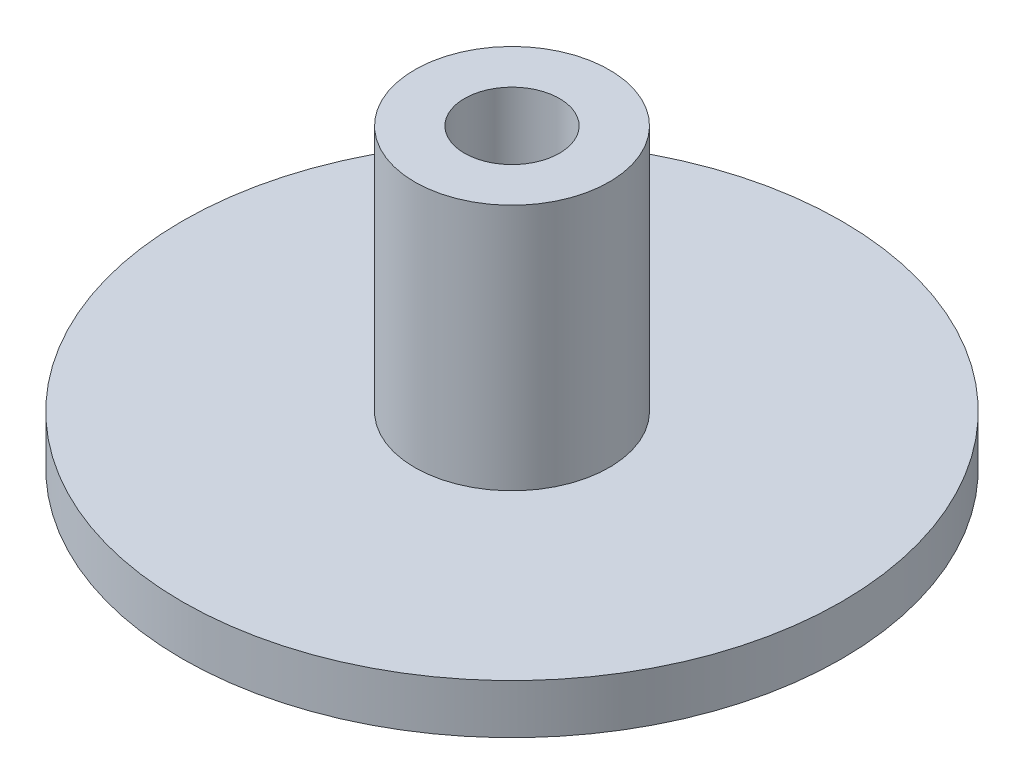
ISO-10303-21;
HEADER;
FILE_DESCRIPTION(('STEP AP214'),'2;1');
FILE_NAME('part.step','',(''),(''),'','','');
FILE_SCHEMA(('AUTOMOTIVE_DESIGN { 1 0 10303 214 1 1 1 1 }'));
ENDSEC;
DATA;
#1=APPLICATION_CONTEXT('core data for automotive mechanical design processes');
#2=APPLICATION_PROTOCOL_DEFINITION('international standard','automotive_design',2000,#1);
#3=PRODUCT_CONTEXT('',#1,'mechanical');
#4=PRODUCT('Part','Part','',(#3));
#5=PRODUCT_RELATED_PRODUCT_CATEGORY('part','',(#4));
#6=PRODUCT_DEFINITION_FORMATION('','',#4);
#7=PRODUCT_DEFINITION_CONTEXT('part definition',#1,'design');
#8=PRODUCT_DEFINITION('design','',#6,#7);
#9=PRODUCT_DEFINITION_SHAPE('','',#8);
#10=(LENGTH_UNIT() NAMED_UNIT(*) SI_UNIT(.MILLI.,.METRE.));
#11=(NAMED_UNIT(*) PLANE_ANGLE_UNIT() SI_UNIT($,.RADIAN.));
#12=(NAMED_UNIT(*) SI_UNIT($,.STERADIAN.) SOLID_ANGLE_UNIT());
#13=UNCERTAINTY_MEASURE_WITH_UNIT(LENGTH_MEASURE(1.E-05),#10,'distance_accuracy_value','');
#14=(GEOMETRIC_REPRESENTATION_CONTEXT(3) GLOBAL_UNCERTAINTY_ASSIGNED_CONTEXT((#13)) GLOBAL_UNIT_ASSIGNED_CONTEXT((#10,
#11,#12)) REPRESENTATION_CONTEXT('',''));
#15=CARTESIAN_POINT('',(0.,0.,0.));
#16=DIRECTION('',(0.,0.,1.));
#17=DIRECTION('',(1.,0.,0.));
#18=AXIS2_PLACEMENT_3D('',#15,#16,#17);
#19=CARTESIAN_POINT('',(0.,1.5,0.));
#20=DIRECTION('',(0.,-1.,0.));
#21=DIRECTION('',(0.,0.,-1.));
#22=AXIS2_PLACEMENT_3D('',#19,#20,#21);
#23=CYLINDRICAL_SURFACE('',#22,10.);
#24=CARTESIAN_POINT('',(0.,1.5,0.));
#25=DIRECTION('',(0.,1.,0.));
#26=DIRECTION('',(0.,0.,1.));
#27=AXIS2_PLACEMENT_3D('',#24,#25,#26);
#28=CIRCLE('',#27,10.);
#29=CARTESIAN_POINT('',(0.,1.5,10.));
#30=VERTEX_POINT('',#29);
#31=EDGE_CURVE('E10',#30,#30,#28,.T.);
#32=ORIENTED_EDGE('',*,*,#31,.F.);
#33=EDGE_LOOP('',(#32));
#34=FACE_BOUND('',#33,.T.);
#35=CARTESIAN_POINT('',(0.,0.,0.));
#36=DIRECTION('',(0.,1.,0.));
#37=DIRECTION('',(0.,0.,1.));
#38=AXIS2_PLACEMENT_3D('',#35,#36,#37);
#39=CIRCLE('',#38,10.);
#40=CARTESIAN_POINT('',(0.,0.,10.));
#41=VERTEX_POINT('',#40);
#42=EDGE_CURVE('E34',#41,#41,#39,.T.);
#43=ORIENTED_EDGE('',*,*,#42,.T.);
#44=EDGE_LOOP('',(#43));
#45=FACE_BOUND('',#44,.T.);
#46=ADVANCED_FACE('F31',(#34,#45),#23,.T.);
#47=CARTESIAN_POINT('',(0.,1.5,0.));
#48=DIRECTION('',(0.,1.,0.));
#49=DIRECTION('',(0.,0.,1.));
#50=AXIS2_PLACEMENT_3D('',#47,#48,#49);
#51=PLANE('',#50);
#52=CARTESIAN_POINT('',(0.,1.5,0.));
#53=DIRECTION('',(0.,1.,0.));
#54=DIRECTION('',(0.,0.,1.));
#55=AXIS2_PLACEMENT_3D('',#52,#53,#54);
#56=CIRCLE('',#55,2.95);
#57=CARTESIAN_POINT('',(0.,1.5,2.95));
#58=VERTEX_POINT('',#57);
#59=EDGE_CURVE('E38',#58,#58,#56,.T.);
#60=ORIENTED_EDGE('',*,*,#59,.F.);
#61=EDGE_LOOP('',(#60));
#62=FACE_BOUND('',#61,.T.);
#63=ORIENTED_EDGE('',*,*,#31,.T.);
#64=EDGE_LOOP('',(#63));
#65=FACE_BOUND('',#64,.T.);
#66=ADVANCED_FACE('F73',(#62,#65),#51,.T.);
#67=CARTESIAN_POINT('',(0.,0.,0.));
#68=DIRECTION('',(0.,1.,0.));
#69=DIRECTION('',(0.,0.,1.));
#70=AXIS2_PLACEMENT_3D('',#67,#68,#69);
#71=PLANE('',#70);
#72=ORIENTED_EDGE('',*,*,#42,.F.);
#73=EDGE_LOOP('',(#72));
#74=FACE_BOUND('',#73,.T.);
#75=CARTESIAN_POINT('',(0.,0.,0.));
#76=DIRECTION('',(0.,1.,0.));
#77=DIRECTION('',(0.,0.,1.));
#78=AXIS2_PLACEMENT_3D('',#75,#76,#77);
#79=CIRCLE('',#78,1.44);
#80=CARTESIAN_POINT('',(0.,0.,1.44));
#81=VERTEX_POINT('',#80);
#82=EDGE_CURVE('E44',#81,#81,#79,.T.);
#83=ORIENTED_EDGE('',*,*,#82,.T.);
#84=EDGE_LOOP('',(#83));
#85=FACE_BOUND('',#84,.T.);
#86=ADVANCED_FACE('F70',(#74,#85),#71,.F.);
#87=CARTESIAN_POINT('',(0.,9.,0.));
#88=DIRECTION('',(0.,-1.,0.));
#89=DIRECTION('',(0.,0.,-1.));
#90=AXIS2_PLACEMENT_3D('',#87,#88,#89);
#91=CYLINDRICAL_SURFACE('',#90,1.44);
#92=CARTESIAN_POINT('',(0.,9.,0.));
#93=DIRECTION('',(0.,1.,0.));
#94=DIRECTION('',(0.,0.,1.));
#95=AXIS2_PLACEMENT_3D('',#92,#93,#94);
#96=CIRCLE('',#95,1.44);
#97=CARTESIAN_POINT('',(0.,9.,1.44));
#98=VERTEX_POINT('',#97);
#99=EDGE_CURVE('E47',#98,#98,#96,.T.);
#100=ORIENTED_EDGE('',*,*,#99,.T.);
#101=EDGE_LOOP('',(#100));
#102=FACE_BOUND('',#101,.T.);
#103=ORIENTED_EDGE('',*,*,#82,.F.);
#104=EDGE_LOOP('',(#103));
#105=FACE_BOUND('',#104,.T.);
#106=ADVANCED_FACE('F54',(#102,#105),#91,.F.);
#107=CARTESIAN_POINT('',(0.,9.,0.));
#108=DIRECTION('',(0.,-1.,0.));
#109=DIRECTION('',(0.,0.,-1.));
#110=AXIS2_PLACEMENT_3D('',#107,#108,#109);
#111=CYLINDRICAL_SURFACE('',#110,2.95);
#112=ORIENTED_EDGE('',*,*,#59,.T.);
#113=EDGE_LOOP('',(#112));
#114=FACE_BOUND('',#113,.T.);
#115=CARTESIAN_POINT('',(0.,9.,0.));
#116=DIRECTION('',(0.,1.,0.));
#117=DIRECTION('',(0.,0.,1.));
#118=AXIS2_PLACEMENT_3D('',#115,#116,#117);
#119=CIRCLE('',#118,2.95);
#120=CARTESIAN_POINT('',(0.,9.,2.95));
#121=VERTEX_POINT('',#120);
#122=EDGE_CURVE('E48',#121,#121,#119,.T.);
#123=ORIENTED_EDGE('',*,*,#122,.F.);
#124=EDGE_LOOP('',(#123));
#125=FACE_BOUND('',#124,.T.);
#126=ADVANCED_FACE('F60',(#114,#125),#111,.T.);
#127=CARTESIAN_POINT('',(0.,9.,0.));
#128=DIRECTION('',(0.,1.,0.));
#129=DIRECTION('',(0.,0.,1.));
#130=AXIS2_PLACEMENT_3D('',#127,#128,#129);
#131=PLANE('',#130);
#132=ORIENTED_EDGE('',*,*,#99,.F.);
#133=EDGE_LOOP('',(#132));
#134=FACE_BOUND('',#133,.T.);
#135=ORIENTED_EDGE('',*,*,#122,.T.);
#136=EDGE_LOOP('',(#135));
#137=FACE_BOUND('',#136,.T.);
#138=ADVANCED_FACE('F57',(#134,#137),#131,.T.);
#139=CLOSED_SHELL('',(#46,#66,#86,#106,#126,#138));
#140=MANIFOLD_SOLID_BREP('B2',#139);
#141=ADVANCED_BREP_SHAPE_REPRESENTATION('',(#18,#140),#14);
#142=SHAPE_DEFINITION_REPRESENTATION(#9,#141);
ENDSEC;
END-ISO-10303-21;
